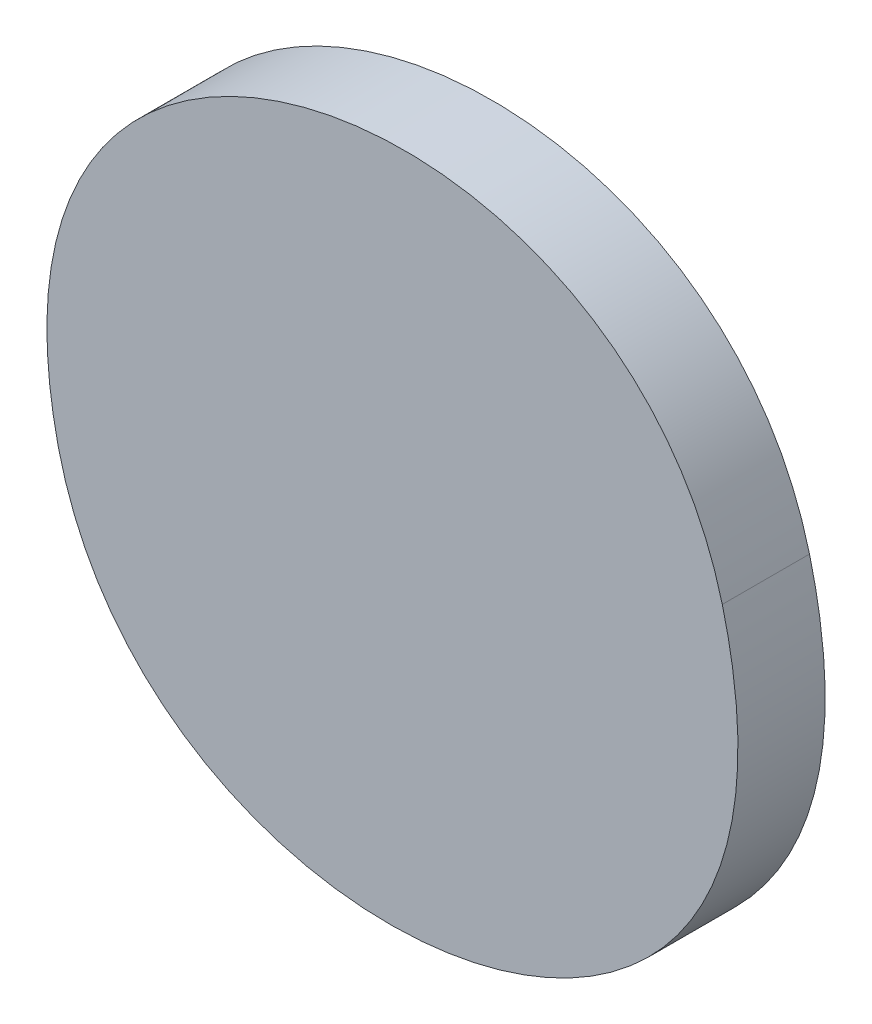
ISO-10303-21;
HEADER;
FILE_DESCRIPTION(('STEP AP214'),'2;1');
FILE_NAME('part.step','',(''),(''),'','','');
FILE_SCHEMA(('AUTOMOTIVE_DESIGN { 1 0 10303 214 1 1 1 1 }'));
ENDSEC;
DATA;
#1=APPLICATION_CONTEXT('core data for automotive mechanical design processes');
#2=APPLICATION_PROTOCOL_DEFINITION('international standard','automotive_design',2000,#1);
#3=PRODUCT_CONTEXT('',#1,'mechanical');
#4=PRODUCT('Part','Part','',(#3));
#5=PRODUCT_RELATED_PRODUCT_CATEGORY('part','',(#4));
#6=PRODUCT_DEFINITION_FORMATION('','',#4);
#7=PRODUCT_DEFINITION_CONTEXT('part definition',#1,'design');
#8=PRODUCT_DEFINITION('design','',#6,#7);
#9=PRODUCT_DEFINITION_SHAPE('','',#8);
#10=(LENGTH_UNIT() NAMED_UNIT(*) SI_UNIT(.MILLI.,.METRE.));
#11=(NAMED_UNIT(*) PLANE_ANGLE_UNIT() SI_UNIT($,.RADIAN.));
#12=(NAMED_UNIT(*) SI_UNIT($,.STERADIAN.) SOLID_ANGLE_UNIT());
#13=UNCERTAINTY_MEASURE_WITH_UNIT(LENGTH_MEASURE(1.E-05),#10,'distance_accuracy_value','');
#14=(GEOMETRIC_REPRESENTATION_CONTEXT(3) GLOBAL_UNCERTAINTY_ASSIGNED_CONTEXT((#13)) GLOBAL_UNIT_ASSIGNED_CONTEXT((#10,
#11,#12)) REPRESENTATION_CONTEXT('',''));
#15=CARTESIAN_POINT('',(0.,0.,0.));
#16=DIRECTION('',(0.,0.,1.));
#17=DIRECTION('',(1.,0.,0.));
#18=AXIS2_PLACEMENT_3D('',#15,#16,#17);
#19=CARTESIAN_POINT('',(-1.9842847265625,-48.5950138671875,0.001));
#20=CARTESIAN_POINT('',(-1.9842847265625,-48.5950138671875,0.));
#21=CARTESIAN_POINT('',(-1.983228984375,-48.59958875,0.001));
#22=CARTESIAN_POINT('',(-1.983228984375,-48.59958875,0.));
#23=CARTESIAN_POINT('',(-1.9751989453125,-48.598501015625,0.001));
#24=CARTESIAN_POINT('',(-1.9751989453125,-48.598501015625,0.));
#25=CARTESIAN_POINT('',(-1.9766705859375,-48.5927744140625,0.001));
#26=CARTESIAN_POINT('',(-1.9766705859375,-48.5927744140625,0.));
#27=B_SPLINE_SURFACE_WITH_KNOTS('',3,1,((#19,#20),(#21,#22),(#23,#24),(#25,#26)),.UNSPECIFIED.,
.F.,.F.,.F.,(4,4),(2,2),(0.,0.333333333333333),(0.,1.),.UNSPECIFIED.);
#28=CARTESIAN_POINT('',(-1.9842847265625,-48.5950138671875,0.));
#29=CARTESIAN_POINT('',(-1.983228984375,-48.59958875,0.));
#30=CARTESIAN_POINT('',(-1.9751989453125,-48.598501015625,0.));
#31=CARTESIAN_POINT('',(-1.9766705859375,-48.5927744140625,0.));
#32=B_SPLINE_CURVE_WITH_KNOTS('',3,(#28,#29,#30,#31),.UNSPECIFIED.,.F.,.F.,(4,4),(0.,
0.333333333333333),.UNSPECIFIED.);
#33=CARTESIAN_POINT('',(-1.9842847265625,-48.5950138671875,0.));
#34=VERTEX_POINT('',#33);
#35=CARTESIAN_POINT('',(-1.9766705859375,-48.5927744140625,0.));
#36=VERTEX_POINT('',#35);
#37=EDGE_CURVE('E11',#34,#36,#32,.T.);
#38=DIRECTION('',(0.,0.,-1.));
#39=VECTOR('',#38,1.);
#40=CARTESIAN_POINT('',(-1.9766705859375,-48.5927744140625,0.001));
#41=LINE('',#40,#39);
#42=CARTESIAN_POINT('',(-1.9766705859375,-48.5927744140625,0.001));
#43=VERTEX_POINT('',#42);
#44=EDGE_CURVE('E28',#43,#36,#41,.T.);
#45=CARTESIAN_POINT('',(-1.9842847265625,-48.5950138671875,0.001));
#46=CARTESIAN_POINT('',(-1.983228984375,-48.59958875,0.001));
#47=CARTESIAN_POINT('',(-1.9751989453125,-48.598501015625,0.001));
#48=CARTESIAN_POINT('',(-1.9766705859375,-48.5927744140625,0.001));
#49=B_SPLINE_CURVE_WITH_KNOTS('',3,(#45,#46,#47,#48),.UNSPECIFIED.,.F.,.F.,(4,4),(0.,
0.333333333333333),.UNSPECIFIED.);
#50=CARTESIAN_POINT('',(-1.9842847265625,-48.5950138671875,0.001));
#51=VERTEX_POINT('',#50);
#52=EDGE_CURVE('E51',#51,#43,#49,.T.);
#53=DIRECTION('',(0.,0.,-1.));
#54=VECTOR('',#53,1.);
#55=CARTESIAN_POINT('',(-1.9842847265625,-48.5950138671875,0.001));
#56=LINE('',#55,#54);
#57=EDGE_CURVE('E40',#51,#34,#56,.T.);
#58=ORIENTED_EDGE('',*,*,#37,.T.);
#59=ORIENTED_EDGE('',*,*,#44,.F.);
#60=ORIENTED_EDGE('',*,*,#52,.F.);
#61=ORIENTED_EDGE('',*,*,#57,.T.);
#62=EDGE_LOOP('',(#58,#59,#60,#61));
#63=FACE_BOUND('',#62,.T.);
#64=ADVANCED_FACE('F17',(#63),#27,.F.);
#65=CARTESIAN_POINT('',(-1.9766705859375,-48.5927744140625,0.001));
#66=CARTESIAN_POINT('',(-1.9766705859375,-48.5927744140625,0.));
#67=CARTESIAN_POINT('',(-1.9778223046875,-48.5882955078125,0.001));
#68=CARTESIAN_POINT('',(-1.9778223046875,-48.5882955078125,0.));
#69=CARTESIAN_POINT('',(-1.9855004296875,-48.589671171875,0.001));
#70=CARTESIAN_POINT('',(-1.9855004296875,-48.589671171875,0.));
#71=CARTESIAN_POINT('',(-1.9842847265625,-48.5950138671875,0.001));
#72=CARTESIAN_POINT('',(-1.9842847265625,-48.5950138671875,0.));
#73=B_SPLINE_SURFACE_WITH_KNOTS('',3,1,((#65,#66),(#67,#68),(#69,#70),(#71,#72)),.UNSPECIFIED.,
.F.,.F.,.F.,(4,4),(2,2),(0.333333333333333,1.),(0.,1.),.UNSPECIFIED.);
#74=CARTESIAN_POINT('',(-1.9766705859375,-48.5927744140625,0.));
#75=CARTESIAN_POINT('',(-1.9778223046875,-48.5882955078125,0.));
#76=CARTESIAN_POINT('',(-1.9855004296875,-48.589671171875,0.));
#77=CARTESIAN_POINT('',(-1.9842847265625,-48.5950138671875,0.));
#78=B_SPLINE_CURVE_WITH_KNOTS('',3,(#74,#75,#76,#77),.UNSPECIFIED.,.F.,.F.,(4,4),
(0.333333333333333,1.),.UNSPECIFIED.);
#79=EDGE_CURVE('E50',#36,#34,#78,.T.);
#80=CARTESIAN_POINT('',(-1.9766705859375,-48.5927744140625,0.001));
#81=CARTESIAN_POINT('',(-1.9778223046875,-48.5882955078125,0.001));
#82=CARTESIAN_POINT('',(-1.9855004296875,-48.589671171875,0.001));
#83=CARTESIAN_POINT('',(-1.9842847265625,-48.5950138671875,0.001));
#84=B_SPLINE_CURVE_WITH_KNOTS('',3,(#80,#81,#82,#83),.UNSPECIFIED.,.F.,.F.,(4,4),
(0.333333333333333,1.),.UNSPECIFIED.);
#85=EDGE_CURVE('E48',#43,#51,#84,.T.);
#86=ORIENTED_EDGE('',*,*,#79,.T.);
#87=ORIENTED_EDGE('',*,*,#57,.F.);
#88=ORIENTED_EDGE('',*,*,#85,.F.);
#89=ORIENTED_EDGE('',*,*,#44,.T.);
#90=EDGE_LOOP('',(#86,#87,#88,#89));
#91=FACE_BOUND('',#90,.T.);
#92=ADVANCED_FACE('F46',(#91),#73,.F.);
#93=CARTESIAN_POINT('',(0.,0.,0.001));
#94=DIRECTION('',(0.,0.,1.));
#95=DIRECTION('',(1.,0.,0.));
#96=AXIS2_PLACEMENT_3D('',#93,#94,#95);
#97=PLANE('',#96);
#98=ORIENTED_EDGE('',*,*,#52,.T.);
#99=ORIENTED_EDGE('',*,*,#85,.T.);
#100=EDGE_LOOP('',(#98,#99));
#101=FACE_BOUND('',#100,.T.);
#102=ADVANCED_FACE('F55',(#101),#97,.T.);
#103=CARTESIAN_POINT('',(0.,0.,0.));
#104=DIRECTION('',(0.,0.,1.));
#105=DIRECTION('',(1.,0.,0.));
#106=AXIS2_PLACEMENT_3D('',#103,#104,#105);
#107=PLANE('',#106);
#108=ORIENTED_EDGE('',*,*,#37,.F.);
#109=ORIENTED_EDGE('',*,*,#79,.F.);
#110=EDGE_LOOP('',(#108,#109));
#111=FACE_BOUND('',#110,.T.);
#112=ADVANCED_FACE('F74',(#111),#107,.F.);
#113=CLOSED_SHELL('',(#64,#92,#102,#112));
#114=MANIFOLD_SOLID_BREP('B1',#113);
#115=ADVANCED_BREP_SHAPE_REPRESENTATION('',(#18,#114),#14);
#116=SHAPE_DEFINITION_REPRESENTATION(#9,#115);
ENDSEC;
END-ISO-10303-21;
